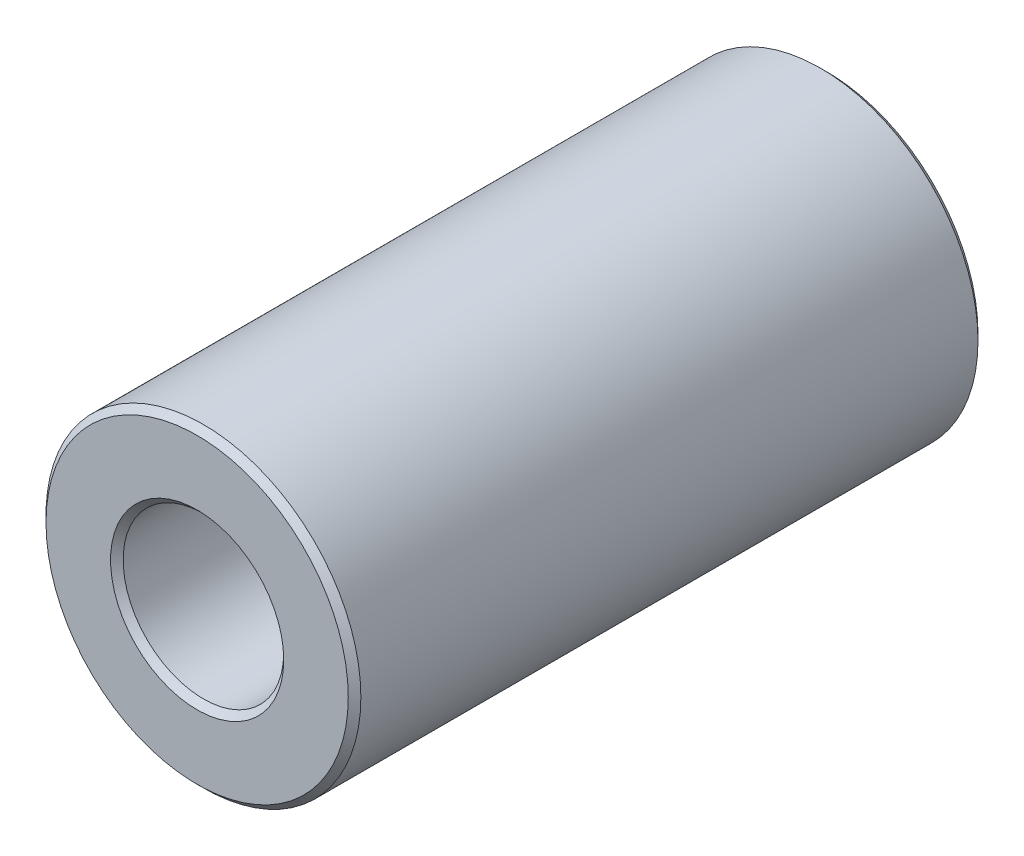
ISO-10303-21;
HEADER;
FILE_DESCRIPTION(('STEP AP214'),'2;1');
FILE_NAME('part.step','',(''),(''),'','','');
FILE_SCHEMA(('AUTOMOTIVE_DESIGN { 1 0 10303 214 1 1 1 1 }'));
ENDSEC;
DATA;
#1=APPLICATION_CONTEXT('core data for automotive mechanical design processes');
#2=APPLICATION_PROTOCOL_DEFINITION('international standard','automotive_design',2000,#1);
#3=PRODUCT_CONTEXT('',#1,'mechanical');
#4=PRODUCT('Part','Part','',(#3));
#5=PRODUCT_RELATED_PRODUCT_CATEGORY('part','',(#4));
#6=PRODUCT_DEFINITION_FORMATION('','',#4);
#7=PRODUCT_DEFINITION_CONTEXT('part definition',#1,'design');
#8=PRODUCT_DEFINITION('design','',#6,#7);
#9=PRODUCT_DEFINITION_SHAPE('','',#8);
#10=(LENGTH_UNIT() NAMED_UNIT(*) SI_UNIT(.MILLI.,.METRE.));
#11=(NAMED_UNIT(*) PLANE_ANGLE_UNIT() SI_UNIT($,.RADIAN.));
#12=(NAMED_UNIT(*) SI_UNIT($,.STERADIAN.) SOLID_ANGLE_UNIT());
#13=UNCERTAINTY_MEASURE_WITH_UNIT(LENGTH_MEASURE(1.E-05),#10,'distance_accuracy_value','');
#14=(GEOMETRIC_REPRESENTATION_CONTEXT(3) GLOBAL_UNCERTAINTY_ASSIGNED_CONTEXT((#13)) GLOBAL_UNIT_ASSIGNED_CONTEXT((#10,
#11,#12)) REPRESENTATION_CONTEXT('',''));
#15=CARTESIAN_POINT('',(0.,0.,0.));
#16=DIRECTION('',(0.,0.,1.));
#17=DIRECTION('',(1.,0.,0.));
#18=AXIS2_PLACEMENT_3D('',#15,#16,#17);
#19=CARTESIAN_POINT('',(0.,0.,20.));
#20=DIRECTION('',(0.,0.,1.));
#21=DIRECTION('',(1.,0.,0.));
#22=AXIS2_PLACEMENT_3D('',#19,#20,#21);
#23=PLANE('',#22);
#24=CARTESIAN_POINT('',(0.,0.,20.));
#25=DIRECTION('',(0.,0.,1.));
#26=DIRECTION('',(1.,0.,0.));
#27=AXIS2_PLACEMENT_3D('',#24,#25,#26);
#28=CIRCLE('',#27,2.75);
#29=CARTESIAN_POINT('',(2.75,0.,20.));
#30=VERTEX_POINT('',#29);
#31=EDGE_CURVE('E10',#30,#30,#28,.F.);
#32=ORIENTED_EDGE('',*,*,#31,.T.);
#33=EDGE_LOOP('',(#32));
#34=FACE_BOUND('',#33,.T.);
#35=CARTESIAN_POINT('',(0.,0.,20.));
#36=DIRECTION('',(0.,0.,1.));
#37=DIRECTION('',(1.,0.,0.));
#38=AXIS2_PLACEMENT_3D('',#35,#36,#37);
#39=CIRCLE('',#38,4.8);
#40=CARTESIAN_POINT('',(4.8,0.,20.));
#41=VERTEX_POINT('',#40);
#42=EDGE_CURVE('E41',#41,#41,#39,.T.);
#43=ORIENTED_EDGE('',*,*,#42,.T.);
#44=EDGE_LOOP('',(#43));
#45=FACE_BOUND('',#44,.T.);
#46=ADVANCED_FACE('F34',(#34,#45),#23,.T.);
#47=CARTESIAN_POINT('',(0.,0.,0.));
#48=DIRECTION('',(0.,0.,1.));
#49=DIRECTION('',(1.,0.,0.));
#50=AXIS2_PLACEMENT_3D('',#47,#48,#49);
#51=PLANE('',#50);
#52=CARTESIAN_POINT('',(0.,0.,0.));
#53=DIRECTION('',(0.,0.,1.));
#54=DIRECTION('',(1.,0.,0.));
#55=AXIS2_PLACEMENT_3D('',#52,#53,#54);
#56=CIRCLE('',#55,4.8);
#57=CARTESIAN_POINT('',(4.8,0.,0.));
#58=VERTEX_POINT('',#57);
#59=EDGE_CURVE('E54',#58,#58,#56,.F.);
#60=ORIENTED_EDGE('',*,*,#59,.T.);
#61=EDGE_LOOP('',(#60));
#62=FACE_BOUND('',#61,.T.);
#63=CARTESIAN_POINT('',(0.,0.,0.));
#64=DIRECTION('',(0.,0.,1.));
#65=DIRECTION('',(1.,0.,0.));
#66=AXIS2_PLACEMENT_3D('',#63,#64,#65);
#67=CIRCLE('',#66,2.75);
#68=CARTESIAN_POINT('',(2.75,0.,0.));
#69=VERTEX_POINT('',#68);
#70=EDGE_CURVE('E57',#69,#69,#67,.T.);
#71=ORIENTED_EDGE('',*,*,#70,.T.);
#72=EDGE_LOOP('',(#71));
#73=FACE_BOUND('',#72,.T.);
#74=ADVANCED_FACE('F78',(#62,#73),#51,.F.);
#75=CARTESIAN_POINT('',(0.,0.,20.));
#76=DIRECTION('',(0.,0.,-1.));
#77=DIRECTION('',(-1.,0.,0.));
#78=AXIS2_PLACEMENT_3D('',#75,#76,#77);
#79=CYLINDRICAL_SURFACE('',#78,5.);
#80=CARTESIAN_POINT('',(0.,0.,0.200000000000002));
#81=DIRECTION('',(0.,0.,1.));
#82=DIRECTION('',(1.,0.,0.));
#83=AXIS2_PLACEMENT_3D('',#80,#81,#82);
#84=CIRCLE('',#83,5.);
#85=CARTESIAN_POINT('',(5.,0.,0.200000000000002));
#86=VERTEX_POINT('',#85);
#87=EDGE_CURVE('E60',#86,#86,#84,.T.);
#88=ORIENTED_EDGE('',*,*,#87,.T.);
#89=EDGE_LOOP('',(#88));
#90=FACE_BOUND('',#89,.T.);
#91=CARTESIAN_POINT('',(0.,0.,19.8));
#92=DIRECTION('',(0.,0.,1.));
#93=DIRECTION('',(1.,0.,0.));
#94=AXIS2_PLACEMENT_3D('',#91,#92,#93);
#95=CIRCLE('',#94,5.);
#96=CARTESIAN_POINT('',(5.,0.,19.8));
#97=VERTEX_POINT('',#96);
#98=EDGE_CURVE('E63',#97,#97,#95,.F.);
#99=ORIENTED_EDGE('',*,*,#98,.T.);
#100=EDGE_LOOP('',(#99));
#101=FACE_BOUND('',#100,.T.);
#102=ADVANCED_FACE('F67',(#90,#101),#79,.T.);
#103=CARTESIAN_POINT('',(0.,0.,20.));
#104=DIRECTION('',(0.,0.,-1.));
#105=DIRECTION('',(-1.,0.,0.));
#106=AXIS2_PLACEMENT_3D('',#103,#104,#105);
#107=CYLINDRICAL_SURFACE('',#106,2.55);
#108=CARTESIAN_POINT('',(0.,0.,0.199999999999999));
#109=DIRECTION('',(0.,0.,1.));
#110=DIRECTION('',(1.,0.,0.));
#111=AXIS2_PLACEMENT_3D('',#108,#109,#110);
#112=CIRCLE('',#111,2.55);
#113=CARTESIAN_POINT('',(2.55,0.,0.199999999999999));
#114=VERTEX_POINT('',#113);
#115=EDGE_CURVE('E45',#114,#114,#112,.F.);
#116=ORIENTED_EDGE('',*,*,#115,.T.);
#117=EDGE_LOOP('',(#116));
#118=FACE_BOUND('',#117,.T.);
#119=CARTESIAN_POINT('',(0.,0.,19.8));
#120=DIRECTION('',(0.,0.,1.));
#121=DIRECTION('',(1.,0.,0.));
#122=AXIS2_PLACEMENT_3D('',#119,#120,#121);
#123=CIRCLE('',#122,2.55);
#124=CARTESIAN_POINT('',(2.55,0.,19.8));
#125=VERTEX_POINT('',#124);
#126=EDGE_CURVE('E49',#125,#125,#123,.T.);
#127=ORIENTED_EDGE('',*,*,#126,.T.);
#128=EDGE_LOOP('',(#127));
#129=FACE_BOUND('',#128,.T.);
#130=ADVANCED_FACE('F86',(#118,#129),#107,.F.);
#131=CARTESIAN_POINT('',(0.,0.,0.200000000000002));
#132=DIRECTION('',(0.,0.,1.));
#133=DIRECTION('',(1.,0.,0.));
#134=AXIS2_PLACEMENT_3D('',#131,#132,#133);
#135=CONICAL_SURFACE('',#134,5.,0.78539816339745);
#136=ORIENTED_EDGE('',*,*,#59,.F.);
#137=EDGE_LOOP('',(#136));
#138=FACE_BOUND('',#137,.T.);
#139=ORIENTED_EDGE('',*,*,#87,.F.);
#140=EDGE_LOOP('',(#139));
#141=FACE_BOUND('',#140,.T.);
#142=ADVANCED_FACE('F91',(#138,#141),#135,.T.);
#143=CARTESIAN_POINT('',(0.,0.,0.));
#144=DIRECTION('',(0.,0.,-1.));
#145=DIRECTION('',(-1.,0.,0.));
#146=AXIS2_PLACEMENT_3D('',#143,#144,#145);
#147=CONICAL_SURFACE('',#146,2.75,0.785398163397449);
#148=ORIENTED_EDGE('',*,*,#115,.F.);
#149=EDGE_LOOP('',(#148));
#150=FACE_BOUND('',#149,.T.);
#151=ORIENTED_EDGE('',*,*,#70,.F.);
#152=EDGE_LOOP('',(#151));
#153=FACE_BOUND('',#152,.T.);
#154=ADVANCED_FACE('F75',(#150,#153),#147,.F.);
#155=CARTESIAN_POINT('',(0.,0.,19.8));
#156=DIRECTION('',(0.,0.,1.));
#157=DIRECTION('',(1.,0.,0.));
#158=AXIS2_PLACEMENT_3D('',#155,#156,#157);
#159=CONICAL_SURFACE('',#158,2.55,0.785398163397449);
#160=ORIENTED_EDGE('',*,*,#31,.F.);
#161=EDGE_LOOP('',(#160));
#162=FACE_BOUND('',#161,.T.);
#163=ORIENTED_EDGE('',*,*,#126,.F.);
#164=EDGE_LOOP('',(#163));
#165=FACE_BOUND('',#164,.T.);
#166=ADVANCED_FACE('F71',(#162,#165),#159,.F.);
#167=CARTESIAN_POINT('',(0.,0.,20.));
#168=DIRECTION('',(0.,0.,-1.));
#169=DIRECTION('',(-1.,0.,0.));
#170=AXIS2_PLACEMENT_3D('',#167,#168,#169);
#171=CONICAL_SURFACE('',#170,4.8,0.785398163397455);
#172=ORIENTED_EDGE('',*,*,#98,.F.);
#173=EDGE_LOOP('',(#172));
#174=FACE_BOUND('',#173,.T.);
#175=ORIENTED_EDGE('',*,*,#42,.F.);
#176=EDGE_LOOP('',(#175));
#177=FACE_BOUND('',#176,.T.);
#178=ADVANCED_FACE('F36',(#174,#177),#171,.T.);
#179=CLOSED_SHELL('',(#46,#74,#102,#130,#142,#154,#166,#178));
#180=MANIFOLD_SOLID_BREP('B2',#179);
#181=ADVANCED_BREP_SHAPE_REPRESENTATION('',(#18,#180),#14);
#182=SHAPE_DEFINITION_REPRESENTATION(#9,#181);
ENDSEC;
END-ISO-10303-21;
